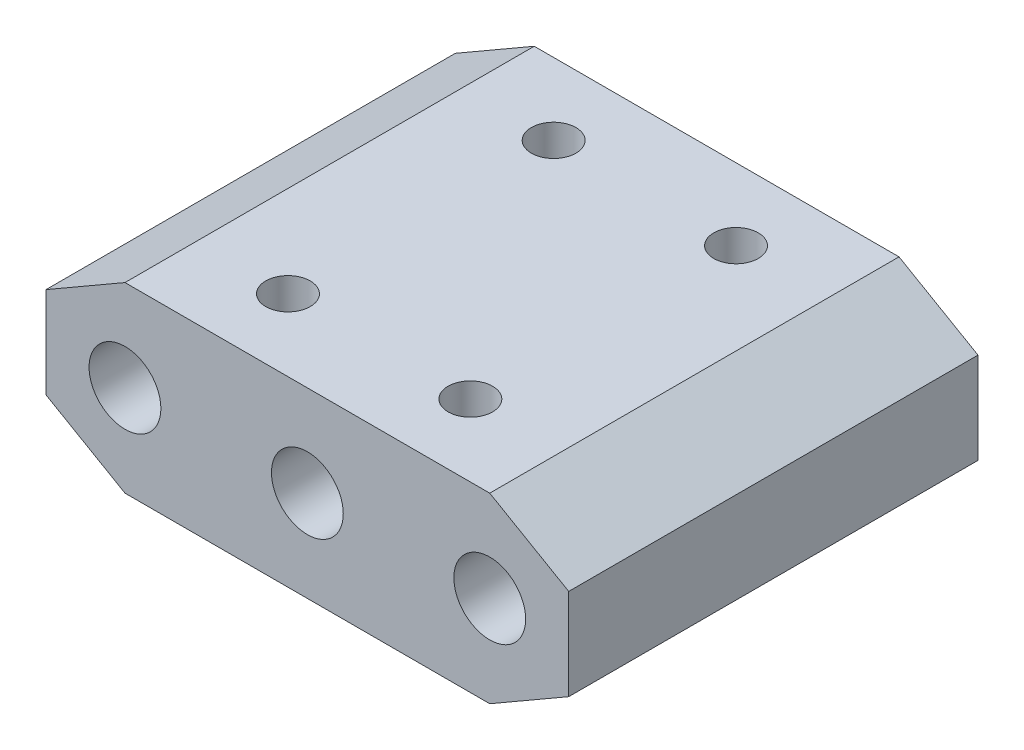
ISO-10303-21;
HEADER;
FILE_DESCRIPTION(('STEP AP214'),'2;1');
FILE_NAME('part.step','',(''),(''),'','','');
FILE_SCHEMA(('AUTOMOTIVE_DESIGN { 1 0 10303 214 1 1 1 1 }'));
ENDSEC;
DATA;
#1=APPLICATION_CONTEXT('core data for automotive mechanical design processes');
#2=APPLICATION_PROTOCOL_DEFINITION('international standard','automotive_design',2000,#1);
#3=PRODUCT_CONTEXT('',#1,'mechanical');
#4=PRODUCT('Part','Part','',(#3));
#5=PRODUCT_RELATED_PRODUCT_CATEGORY('part','',(#4));
#6=PRODUCT_DEFINITION_FORMATION('','',#4);
#7=PRODUCT_DEFINITION_CONTEXT('part definition',#1,'design');
#8=PRODUCT_DEFINITION('design','',#6,#7);
#9=PRODUCT_DEFINITION_SHAPE('','',#8);
#10=(LENGTH_UNIT() NAMED_UNIT(*) SI_UNIT(.MILLI.,.METRE.));
#11=(NAMED_UNIT(*) PLANE_ANGLE_UNIT() SI_UNIT($,.RADIAN.));
#12=(NAMED_UNIT(*) SI_UNIT($,.STERADIAN.) SOLID_ANGLE_UNIT());
#13=UNCERTAINTY_MEASURE_WITH_UNIT(LENGTH_MEASURE(1.E-05),#10,'distance_accuracy_value','');
#14=(GEOMETRIC_REPRESENTATION_CONTEXT(3) GLOBAL_UNCERTAINTY_ASSIGNED_CONTEXT((#13)) GLOBAL_UNIT_ASSIGNED_CONTEXT((#10,
#11,#12)) REPRESENTATION_CONTEXT('',''));
#15=CARTESIAN_POINT('',(0.,0.,0.));
#16=DIRECTION('',(0.,0.,1.));
#17=DIRECTION('',(1.,0.,0.));
#18=AXIS2_PLACEMENT_3D('',#15,#16,#17);
#19=CARTESIAN_POINT('',(0.,0.,-28.5));
#20=DIRECTION('',(0.,-1.,0.));
#21=DIRECTION('',(0.,0.,-1.));
#22=AXIS2_PLACEMENT_3D('',#19,#20,#21);
#23=PLANE('',#22);
#24=CARTESIAN_POINT('',(12.7,0.,-5.));
#25=DIRECTION('',(0.,1.,0.));
#26=DIRECTION('',(-1.,0.,0.));
#27=AXIS2_PLACEMENT_3D('',#24,#25,#26);
#28=CIRCLE('',#27,1.55);
#29=CARTESIAN_POINT('',(11.15,0.,-5.));
#30=VERTEX_POINT('',#29);
#31=EDGE_CURVE('E287',#30,#30,#28,.T.);
#32=ORIENTED_EDGE('',*,*,#31,.T.);
#33=EDGE_LOOP('',(#32));
#34=FACE_BOUND('',#33,.T.);
#35=CARTESIAN_POINT('',(25.4,0.,-5.));
#36=DIRECTION('',(0.,1.,0.));
#37=DIRECTION('',(-1.,0.,0.));
#38=AXIS2_PLACEMENT_3D('',#35,#36,#37);
#39=CIRCLE('',#38,1.55);
#40=CARTESIAN_POINT('',(23.85,0.,-5.));
#41=VERTEX_POINT('',#40);
#42=EDGE_CURVE('E273',#41,#41,#39,.T.);
#43=ORIENTED_EDGE('',*,*,#42,.T.);
#44=EDGE_LOOP('',(#43));
#45=FACE_BOUND('',#44,.T.);
#46=CARTESIAN_POINT('',(25.4,0.,-23.5));
#47=DIRECTION('',(0.,1.,0.));
#48=DIRECTION('',(-1.,0.,0.));
#49=AXIS2_PLACEMENT_3D('',#46,#47,#48);
#50=CIRCLE('',#49,1.55);
#51=CARTESIAN_POINT('',(23.85,0.,-23.5));
#52=VERTEX_POINT('',#51);
#53=EDGE_CURVE('E267',#52,#52,#50,.T.);
#54=ORIENTED_EDGE('',*,*,#53,.T.);
#55=EDGE_LOOP('',(#54));
#56=FACE_BOUND('',#55,.T.);
#57=CARTESIAN_POINT('',(12.7,0.,-23.5));
#58=DIRECTION('',(0.,1.,0.));
#59=DIRECTION('',(-1.,0.,0.));
#60=AXIS2_PLACEMENT_3D('',#57,#58,#59);
#61=CIRCLE('',#60,1.55);
#62=CARTESIAN_POINT('',(11.15,0.,-23.5));
#63=VERTEX_POINT('',#62);
#64=EDGE_CURVE('E295',#63,#63,#61,.T.);
#65=ORIENTED_EDGE('',*,*,#64,.T.);
#66=EDGE_LOOP('',(#65));
#67=FACE_BOUND('',#66,.T.);
#68=DIRECTION('',(1.,0.,0.));
#69=VECTOR('',#68,1.);
#70=CARTESIAN_POINT('',(0.,0.,0.));
#71=LINE('',#70,#69);
#72=CARTESIAN_POINT('',(6.35,0.,0.));
#73=VERTEX_POINT('',#72);
#74=CARTESIAN_POINT('',(31.75,0.,0.));
#75=VERTEX_POINT('',#74);
#76=EDGE_CURVE('E149',#73,#75,#71,.T.);
#77=ORIENTED_EDGE('',*,*,#76,.F.);
#78=DIRECTION('',(0.,0.,1.));
#79=VECTOR('',#78,1.);
#80=CARTESIAN_POINT('',(6.35,0.,-28.5));
#81=LINE('',#80,#79);
#82=CARTESIAN_POINT('',(6.35,0.,-28.5));
#83=VERTEX_POINT('',#82);
#84=EDGE_CURVE('E11',#83,#73,#81,.T.);
#85=ORIENTED_EDGE('',*,*,#84,.F.);
#86=DIRECTION('',(1.,0.,0.));
#87=VECTOR('',#86,1.);
#88=CARTESIAN_POINT('',(0.,0.,-28.5));
#89=LINE('',#88,#87);
#90=CARTESIAN_POINT('',(31.75,0.,-28.5));
#91=VERTEX_POINT('',#90);
#92=EDGE_CURVE('E178',#83,#91,#89,.T.);
#93=ORIENTED_EDGE('',*,*,#92,.T.);
#94=DIRECTION('',(0.,0.,1.));
#95=VECTOR('',#94,1.);
#96=CARTESIAN_POINT('',(31.75,0.,-28.5));
#97=LINE('',#96,#95);
#98=EDGE_CURVE('E49',#91,#75,#97,.T.);
#99=ORIENTED_EDGE('',*,*,#98,.T.);
#100=EDGE_LOOP('',(#77,#85,#93,#99));
#101=FACE_BOUND('',#100,.T.);
#102=ADVANCED_FACE('F46',(#34,#45,#56,#67,#101),#23,.T.);
#103=CARTESIAN_POINT('',(1.5875,2.74963065701559,-28.5));
#104=DIRECTION('',(-0.5,-0.866025403784439,0.));
#105=DIRECTION('',(0.866025403784439,-0.5,0.));
#106=AXIS2_PLACEMENT_3D('',#103,#104,#105);
#107=PLANE('',#106);
#108=DIRECTION('',(0.866025403784439,-0.5,0.));
#109=VECTOR('',#108,1.);
#110=CARTESIAN_POINT('',(1.5875,2.74963065701559,0.));
#111=LINE('',#110,#109);
#112=CARTESIAN_POINT('',(0.850738685968815,3.175,0.));
#113=VERTEX_POINT('',#112);
#114=EDGE_CURVE('E175',#113,#73,#111,.T.);
#115=ORIENTED_EDGE('',*,*,#114,.F.);
#116=DIRECTION('',(0.,0.,1.));
#117=VECTOR('',#116,1.);
#118=CARTESIAN_POINT('',(0.850738685968815,3.175,-28.5));
#119=LINE('',#118,#117);
#120=CARTESIAN_POINT('',(0.850738685968815,3.175,-28.5));
#121=VERTEX_POINT('',#120);
#122=EDGE_CURVE('E56',#121,#113,#119,.T.);
#123=ORIENTED_EDGE('',*,*,#122,.F.);
#124=DIRECTION('',(0.866025403784439,-0.5,0.));
#125=VECTOR('',#124,1.);
#126=CARTESIAN_POINT('',(1.5875,2.74963065701559,-28.5));
#127=LINE('',#126,#125);
#128=EDGE_CURVE('E133',#121,#83,#127,.T.);
#129=ORIENTED_EDGE('',*,*,#128,.T.);
#130=ORIENTED_EDGE('',*,*,#84,.T.);
#131=EDGE_LOOP('',(#115,#123,#129,#130));
#132=FACE_BOUND('',#131,.T.);
#133=ADVANCED_FACE('F198',(#132),#107,.T.);
#134=CARTESIAN_POINT('',(0.850738685968815,0.,-28.5));
#135=DIRECTION('',(-1.,0.,0.));
#136=DIRECTION('',(0.,-1.,0.));
#137=AXIS2_PLACEMENT_3D('',#134,#135,#136);
#138=PLANE('',#137);
#139=DIRECTION('',(0.,-1.,0.));
#140=VECTOR('',#139,1.);
#141=CARTESIAN_POINT('',(0.850738685968815,0.,0.));
#142=LINE('',#141,#140);
#143=CARTESIAN_POINT('',(0.850738685968815,9.525,0.));
#144=VERTEX_POINT('',#143);
#145=EDGE_CURVE('E121',#144,#113,#142,.T.);
#146=ORIENTED_EDGE('',*,*,#145,.F.);
#147=DIRECTION('',(0.,0.,1.));
#148=VECTOR('',#147,1.);
#149=CARTESIAN_POINT('',(0.850738685968815,9.525,-28.5));
#150=LINE('',#149,#148);
#151=CARTESIAN_POINT('',(0.850738685968815,9.525,-28.5));
#152=VERTEX_POINT('',#151);
#153=EDGE_CURVE('E116',#152,#144,#150,.T.);
#154=ORIENTED_EDGE('',*,*,#153,.F.);
#155=DIRECTION('',(0.,-1.,0.));
#156=VECTOR('',#155,1.);
#157=CARTESIAN_POINT('',(0.850738685968815,0.,-28.5));
#158=LINE('',#157,#156);
#159=EDGE_CURVE('E119',#152,#121,#158,.T.);
#160=ORIENTED_EDGE('',*,*,#159,.T.);
#161=ORIENTED_EDGE('',*,*,#122,.T.);
#162=EDGE_LOOP('',(#146,#154,#160,#161));
#163=FACE_BOUND('',#162,.T.);
#164=ADVANCED_FACE('F118',(#163),#138,.T.);
#165=CARTESIAN_POINT('',(-3.91176131403119,6.7753693429844,-28.5));
#166=DIRECTION('',(-0.5,0.866025403784438,0.));
#167=DIRECTION('',(-0.866025403784438,-0.5,0.));
#168=AXIS2_PLACEMENT_3D('',#165,#166,#167);
#169=PLANE('',#168);
#170=DIRECTION('',(-0.866025403784438,-0.5,0.));
#171=VECTOR('',#170,1.);
#172=CARTESIAN_POINT('',(-3.91176131403119,6.7753693429844,0.));
#173=LINE('',#172,#171);
#174=CARTESIAN_POINT('',(6.35000000000001,12.7,0.));
#175=VERTEX_POINT('',#174);
#176=EDGE_CURVE('E170',#175,#144,#173,.T.);
#177=ORIENTED_EDGE('',*,*,#176,.F.);
#178=DIRECTION('',(0.,0.,1.));
#179=VECTOR('',#178,1.);
#180=CARTESIAN_POINT('',(6.35000000000001,12.7,-28.5));
#181=LINE('',#180,#179);
#182=CARTESIAN_POINT('',(6.35000000000001,12.7,-28.5));
#183=VERTEX_POINT('',#182);
#184=EDGE_CURVE('E127',#183,#175,#181,.T.);
#185=ORIENTED_EDGE('',*,*,#184,.F.);
#186=DIRECTION('',(-0.866025403784438,-0.5,0.));
#187=VECTOR('',#186,1.);
#188=CARTESIAN_POINT('',(-3.91176131403119,6.7753693429844,-28.5));
#189=LINE('',#188,#187);
#190=EDGE_CURVE('E132',#183,#152,#189,.T.);
#191=ORIENTED_EDGE('',*,*,#190,.T.);
#192=ORIENTED_EDGE('',*,*,#153,.T.);
#193=EDGE_LOOP('',(#177,#185,#191,#192));
#194=FACE_BOUND('',#193,.T.);
#195=ADVANCED_FACE('F136',(#194),#169,.T.);
#196=CARTESIAN_POINT('',(0.,12.7,-28.5));
#197=DIRECTION('',(0.,-1.,0.));
#198=DIRECTION('',(1.,0.,0.));
#199=AXIS2_PLACEMENT_3D('',#196,#197,#198);
#200=PLANE('',#199);
#201=CARTESIAN_POINT('',(12.7,12.7,-5.));
#202=DIRECTION('',(0.,1.,0.));
#203=DIRECTION('',(-1.,0.,0.));
#204=AXIS2_PLACEMENT_3D('',#201,#202,#203);
#205=CIRCLE('',#204,1.55);
#206=CARTESIAN_POINT('',(11.15,12.7,-5.));
#207=VERTEX_POINT('',#206);
#208=EDGE_CURVE('E291',#207,#207,#205,.T.);
#209=ORIENTED_EDGE('',*,*,#208,.F.);
#210=EDGE_LOOP('',(#209));
#211=FACE_BOUND('',#210,.T.);
#212=CARTESIAN_POINT('',(25.4,12.7,-5.));
#213=DIRECTION('',(0.,1.,0.));
#214=DIRECTION('',(-1.,0.,0.));
#215=AXIS2_PLACEMENT_3D('',#212,#213,#214);
#216=CIRCLE('',#215,1.55);
#217=CARTESIAN_POINT('',(23.85,12.7,-5.));
#218=VERTEX_POINT('',#217);
#219=EDGE_CURVE('E281',#218,#218,#216,.T.);
#220=ORIENTED_EDGE('',*,*,#219,.F.);
#221=EDGE_LOOP('',(#220));
#222=FACE_BOUND('',#221,.T.);
#223=CARTESIAN_POINT('',(25.4,12.7,-23.5));
#224=DIRECTION('',(0.,1.,0.));
#225=DIRECTION('',(-1.,0.,0.));
#226=AXIS2_PLACEMENT_3D('',#223,#224,#225);
#227=CIRCLE('',#226,1.55);
#228=CARTESIAN_POINT('',(23.85,12.7,-23.5));
#229=VERTEX_POINT('',#228);
#230=EDGE_CURVE('E270',#229,#229,#227,.T.);
#231=ORIENTED_EDGE('',*,*,#230,.F.);
#232=EDGE_LOOP('',(#231));
#233=FACE_BOUND('',#232,.T.);
#234=CARTESIAN_POINT('',(12.7,12.7,-23.5));
#235=DIRECTION('',(0.,1.,0.));
#236=DIRECTION('',(-1.,0.,0.));
#237=AXIS2_PLACEMENT_3D('',#234,#235,#236);
#238=CIRCLE('',#237,1.55);
#239=CARTESIAN_POINT('',(11.15,12.7,-23.5));
#240=VERTEX_POINT('',#239);
#241=EDGE_CURVE('E278',#240,#240,#238,.T.);
#242=ORIENTED_EDGE('',*,*,#241,.F.);
#243=EDGE_LOOP('',(#242));
#244=FACE_BOUND('',#243,.T.);
#245=DIRECTION('',(1.,0.,0.));
#246=VECTOR('',#245,1.);
#247=CARTESIAN_POINT('',(0.,12.7,0.));
#248=LINE('',#247,#246);
#249=CARTESIAN_POINT('',(31.75,12.7,0.));
#250=VERTEX_POINT('',#249);
#251=EDGE_CURVE('E166',#175,#250,#248,.T.);
#252=ORIENTED_EDGE('',*,*,#251,.T.);
#253=DIRECTION('',(0.,0.,1.));
#254=VECTOR('',#253,1.);
#255=CARTESIAN_POINT('',(31.75,12.7,-28.5));
#256=LINE('',#255,#254);
#257=CARTESIAN_POINT('',(31.75,12.7,-28.5));
#258=VERTEX_POINT('',#257);
#259=EDGE_CURVE('E184',#258,#250,#256,.T.);
#260=ORIENTED_EDGE('',*,*,#259,.F.);
#261=DIRECTION('',(1.,0.,0.));
#262=VECTOR('',#261,1.);
#263=CARTESIAN_POINT('',(0.,12.7,-28.5));
#264=LINE('',#263,#262);
#265=EDGE_CURVE('E139',#183,#258,#264,.T.);
#266=ORIENTED_EDGE('',*,*,#265,.F.);
#267=ORIENTED_EDGE('',*,*,#184,.T.);
#268=EDGE_LOOP('',(#252,#260,#266,#267));
#269=FACE_BOUND('',#268,.T.);
#270=ADVANCED_FACE('F212',(#211,#222,#233,#244,#269),#200,.F.);
#271=CARTESIAN_POINT('',(13.4367613140312,23.273153285078,-28.5));
#272=DIRECTION('',(0.500000000000001,0.866025403784438,0.));
#273=DIRECTION('',(-0.866025403784438,0.500000000000001,0.));
#274=AXIS2_PLACEMENT_3D('',#271,#272,#273);
#275=PLANE('',#274);
#276=DIRECTION('',(-0.866025403784438,0.500000000000001,0.));
#277=VECTOR('',#276,1.);
#278=CARTESIAN_POINT('',(13.4367613140312,23.273153285078,0.));
#279=LINE('',#278,#277);
#280=CARTESIAN_POINT('',(37.2492613140312,9.52499999999999,0.));
#281=VERTEX_POINT('',#280);
#282=EDGE_CURVE('E162',#281,#250,#279,.T.);
#283=ORIENTED_EDGE('',*,*,#282,.F.);
#284=DIRECTION('',(0.,0.,1.));
#285=VECTOR('',#284,1.);
#286=CARTESIAN_POINT('',(37.2492613140312,9.52499999999999,-28.5));
#287=LINE('',#286,#285);
#288=CARTESIAN_POINT('',(37.2492613140312,9.52499999999999,-28.5));
#289=VERTEX_POINT('',#288);
#290=EDGE_CURVE('E187',#289,#281,#287,.T.);
#291=ORIENTED_EDGE('',*,*,#290,.F.);
#292=DIRECTION('',(-0.866025403784438,0.500000000000001,0.));
#293=VECTOR('',#292,1.);
#294=CARTESIAN_POINT('',(13.4367613140312,23.273153285078,-28.5));
#295=LINE('',#294,#293);
#296=EDGE_CURVE('E143',#289,#258,#295,.T.);
#297=ORIENTED_EDGE('',*,*,#296,.T.);
#298=ORIENTED_EDGE('',*,*,#259,.T.);
#299=EDGE_LOOP('',(#283,#291,#297,#298));
#300=FACE_BOUND('',#299,.T.);
#301=ADVANCED_FACE('F215',(#300),#275,.T.);
#302=CARTESIAN_POINT('',(37.2492613140312,0.,-28.5));
#303=DIRECTION('',(1.,0.,0.));
#304=DIRECTION('',(0.,0.,-1.));
#305=AXIS2_PLACEMENT_3D('',#302,#303,#304);
#306=PLANE('',#305);
#307=DIRECTION('',(0.,1.,0.));
#308=VECTOR('',#307,1.);
#309=CARTESIAN_POINT('',(37.2492613140312,0.,0.));
#310=LINE('',#309,#308);
#311=CARTESIAN_POINT('',(37.2492613140312,3.17499999999999,0.));
#312=VERTEX_POINT('',#311);
#313=EDGE_CURVE('E158',#312,#281,#310,.T.);
#314=ORIENTED_EDGE('',*,*,#313,.F.);
#315=DIRECTION('',(0.,0.,1.));
#316=VECTOR('',#315,1.);
#317=CARTESIAN_POINT('',(37.2492613140312,3.17499999999999,-28.5));
#318=LINE('',#317,#316);
#319=CARTESIAN_POINT('',(37.2492613140312,3.17499999999999,-28.5));
#320=VERTEX_POINT('',#319);
#321=EDGE_CURVE('E189',#320,#312,#318,.T.);
#322=ORIENTED_EDGE('',*,*,#321,.F.);
#323=DIRECTION('',(0.,1.,0.));
#324=VECTOR('',#323,1.);
#325=CARTESIAN_POINT('',(37.2492613140312,0.,-28.5));
#326=LINE('',#325,#324);
#327=EDGE_CURVE('E330',#320,#289,#326,.T.);
#328=ORIENTED_EDGE('',*,*,#327,.T.);
#329=ORIENTED_EDGE('',*,*,#290,.T.);
#330=EDGE_LOOP('',(#314,#322,#328,#329));
#331=FACE_BOUND('',#330,.T.);
#332=ADVANCED_FACE('F219',(#331),#306,.T.);
#333=CARTESIAN_POINT('',(7.93749999999999,-13.748153285078,-28.5));
#334=DIRECTION('',(0.5,-0.866025403784439,0.));
#335=DIRECTION('',(0.866025403784439,0.5,0.));
#336=AXIS2_PLACEMENT_3D('',#333,#334,#335);
#337=PLANE('',#336);
#338=DIRECTION('',(0.866025403784439,0.5,0.));
#339=VECTOR('',#338,1.);
#340=CARTESIAN_POINT('',(7.93749999999999,-13.748153285078,0.));
#341=LINE('',#340,#339);
#342=EDGE_CURVE('E153',#75,#312,#341,.T.);
#343=ORIENTED_EDGE('',*,*,#342,.F.);
#344=ORIENTED_EDGE('',*,*,#98,.F.);
#345=DIRECTION('',(0.866025403784439,0.5,0.));
#346=VECTOR('',#345,1.);
#347=CARTESIAN_POINT('',(7.93749999999999,-13.748153285078,-28.5));
#348=LINE('',#347,#346);
#349=EDGE_CURVE('E327',#91,#320,#348,.T.);
#350=ORIENTED_EDGE('',*,*,#349,.T.);
#351=ORIENTED_EDGE('',*,*,#321,.T.);
#352=EDGE_LOOP('',(#343,#344,#350,#351));
#353=FACE_BOUND('',#352,.T.);
#354=ADVANCED_FACE('F195',(#353),#337,.T.);
#355=CARTESIAN_POINT('',(0.,0.,-28.5));
#356=DIRECTION('',(0.,0.,1.));
#357=DIRECTION('',(1.,0.,0.));
#358=AXIS2_PLACEMENT_3D('',#355,#356,#357);
#359=PLANE('',#358);
#360=CARTESIAN_POINT('',(31.75,6.34999999999999,-28.5));
#361=DIRECTION('',(0.,0.,-1.));
#362=DIRECTION('',(-1.,0.,0.));
#363=AXIS2_PLACEMENT_3D('',#360,#361,#362);
#364=CIRCLE('',#363,2.49999999999999);
#365=CARTESIAN_POINT('',(29.25,6.34999999999999,-28.5));
#366=VERTEX_POINT('',#365);
#367=EDGE_CURVE('E299',#366,#366,#364,.T.);
#368=ORIENTED_EDGE('',*,*,#367,.F.);
#369=EDGE_LOOP('',(#368));
#370=FACE_BOUND('',#369,.T.);
#371=CARTESIAN_POINT('',(19.05,6.34999999999999,-28.5));
#372=DIRECTION('',(0.,0.,-1.));
#373=DIRECTION('',(-1.,0.,0.));
#374=AXIS2_PLACEMENT_3D('',#371,#372,#373);
#375=CIRCLE('',#374,2.49999999999999);
#376=CARTESIAN_POINT('',(16.55,6.34999999999999,-28.5));
#377=VERTEX_POINT('',#376);
#378=EDGE_CURVE('E306',#377,#377,#375,.T.);
#379=ORIENTED_EDGE('',*,*,#378,.F.);
#380=EDGE_LOOP('',(#379));
#381=FACE_BOUND('',#380,.T.);
#382=CARTESIAN_POINT('',(6.35,6.35,-28.5));
#383=DIRECTION('',(0.,0.,-1.));
#384=DIRECTION('',(-1.,0.,0.));
#385=AXIS2_PLACEMENT_3D('',#382,#383,#384);
#386=CIRCLE('',#385,2.49999999999999);
#387=CARTESIAN_POINT('',(3.85000000000001,6.35,-28.5));
#388=VERTEX_POINT('',#387);
#389=EDGE_CURVE('E310',#388,#388,#386,.T.);
#390=ORIENTED_EDGE('',*,*,#389,.F.);
#391=EDGE_LOOP('',(#390));
#392=FACE_BOUND('',#391,.T.);
#393=ORIENTED_EDGE('',*,*,#92,.F.);
#394=ORIENTED_EDGE('',*,*,#128,.F.);
#395=ORIENTED_EDGE('',*,*,#159,.F.);
#396=ORIENTED_EDGE('',*,*,#190,.F.);
#397=ORIENTED_EDGE('',*,*,#265,.T.);
#398=ORIENTED_EDGE('',*,*,#296,.F.);
#399=ORIENTED_EDGE('',*,*,#327,.F.);
#400=ORIENTED_EDGE('',*,*,#349,.F.);
#401=EDGE_LOOP('',(#393,#394,#395,#396,#397,#398,#399,#400));
#402=FACE_BOUND('',#401,.T.);
#403=ADVANCED_FACE('F131',(#370,#381,#392,#402),#359,.F.);
#404=CARTESIAN_POINT('',(0.,0.,0.));
#405=DIRECTION('',(0.,0.,1.));
#406=DIRECTION('',(1.,0.,0.));
#407=AXIS2_PLACEMENT_3D('',#404,#405,#406);
#408=PLANE('',#407);
#409=CARTESIAN_POINT('',(19.05,6.34999999999999,0.));
#410=DIRECTION('',(0.,0.,1.));
#411=DIRECTION('',(1.,0.,0.));
#412=AXIS2_PLACEMENT_3D('',#409,#410,#411);
#413=CIRCLE('',#412,2.49999999999999);
#414=CARTESIAN_POINT('',(21.55,6.34999999999999,0.));
#415=VERTEX_POINT('',#414);
#416=EDGE_CURVE('E314',#415,#415,#413,.T.);
#417=ORIENTED_EDGE('',*,*,#416,.F.);
#418=EDGE_LOOP('',(#417));
#419=FACE_BOUND('',#418,.T.);
#420=CARTESIAN_POINT('',(31.75,6.34999999999999,0.));
#421=DIRECTION('',(0.,0.,1.));
#422=DIRECTION('',(1.,0.,0.));
#423=AXIS2_PLACEMENT_3D('',#420,#421,#422);
#424=CIRCLE('',#423,2.49999999999999);
#425=CARTESIAN_POINT('',(34.25,6.34999999999999,0.));
#426=VERTEX_POINT('',#425);
#427=EDGE_CURVE('E318',#426,#426,#424,.T.);
#428=ORIENTED_EDGE('',*,*,#427,.F.);
#429=EDGE_LOOP('',(#428));
#430=FACE_BOUND('',#429,.T.);
#431=CARTESIAN_POINT('',(6.35,6.35,0.));
#432=DIRECTION('',(0.,0.,1.));
#433=DIRECTION('',(1.,0.,0.));
#434=AXIS2_PLACEMENT_3D('',#431,#432,#433);
#435=CIRCLE('',#434,2.49999999999999);
#436=CARTESIAN_POINT('',(8.84999999999999,6.35,0.));
#437=VERTEX_POINT('',#436);
#438=EDGE_CURVE('E154',#437,#437,#435,.T.);
#439=ORIENTED_EDGE('',*,*,#438,.F.);
#440=EDGE_LOOP('',(#439));
#441=FACE_BOUND('',#440,.T.);
#442=ORIENTED_EDGE('',*,*,#76,.T.);
#443=ORIENTED_EDGE('',*,*,#342,.T.);
#444=ORIENTED_EDGE('',*,*,#313,.T.);
#445=ORIENTED_EDGE('',*,*,#282,.T.);
#446=ORIENTED_EDGE('',*,*,#251,.F.);
#447=ORIENTED_EDGE('',*,*,#176,.T.);
#448=ORIENTED_EDGE('',*,*,#145,.T.);
#449=ORIENTED_EDGE('',*,*,#114,.T.);
#450=EDGE_LOOP('',(#442,#443,#444,#445,#446,#447,#448,#449));
#451=FACE_BOUND('',#450,.T.);
#452=ADVANCED_FACE('F197',(#419,#430,#441,#451),#408,.T.);
#453=CARTESIAN_POINT('',(6.35,6.35,0.));
#454=DIRECTION('',(0.,0.,1.));
#455=DIRECTION('',(1.,0.,0.));
#456=AXIS2_PLACEMENT_3D('',#453,#454,#455);
#457=CYLINDRICAL_SURFACE('',#456,2.49999999999999);
#458=ORIENTED_EDGE('',*,*,#438,.T.);
#459=EDGE_LOOP('',(#458));
#460=FACE_BOUND('',#459,.T.);
#461=ORIENTED_EDGE('',*,*,#389,.T.);
#462=EDGE_LOOP('',(#461));
#463=FACE_BOUND('',#462,.T.);
#464=ADVANCED_FACE('F231',(#460,#463),#457,.F.);
#465=CARTESIAN_POINT('',(31.75,6.34999999999999,0.));
#466=DIRECTION('',(0.,0.,1.));
#467=DIRECTION('',(1.,0.,0.));
#468=AXIS2_PLACEMENT_3D('',#465,#466,#467);
#469=CYLINDRICAL_SURFACE('',#468,2.49999999999999);
#470=ORIENTED_EDGE('',*,*,#427,.T.);
#471=EDGE_LOOP('',(#470));
#472=FACE_BOUND('',#471,.T.);
#473=ORIENTED_EDGE('',*,*,#367,.T.);
#474=EDGE_LOOP('',(#473));
#475=FACE_BOUND('',#474,.T.);
#476=ADVANCED_FACE('F238',(#472,#475),#469,.F.);
#477=CARTESIAN_POINT('',(19.05,6.34999999999999,0.));
#478=DIRECTION('',(0.,0.,1.));
#479=DIRECTION('',(1.,0.,0.));
#480=AXIS2_PLACEMENT_3D('',#477,#478,#479);
#481=CYLINDRICAL_SURFACE('',#480,2.49999999999999);
#482=ORIENTED_EDGE('',*,*,#416,.T.);
#483=EDGE_LOOP('',(#482));
#484=FACE_BOUND('',#483,.T.);
#485=ORIENTED_EDGE('',*,*,#378,.T.);
#486=EDGE_LOOP('',(#485));
#487=FACE_BOUND('',#486,.T.);
#488=ADVANCED_FACE('F242',(#484,#487),#481,.F.);
#489=CARTESIAN_POINT('',(12.7,0.,-23.5));
#490=DIRECTION('',(0.,1.,0.));
#491=DIRECTION('',(-1.,0.,0.));
#492=AXIS2_PLACEMENT_3D('',#489,#490,#491);
#493=CYLINDRICAL_SURFACE('',#492,1.55);
#494=ORIENTED_EDGE('',*,*,#64,.F.);
#495=EDGE_LOOP('',(#494));
#496=FACE_BOUND('',#495,.T.);
#497=ORIENTED_EDGE('',*,*,#241,.T.);
#498=EDGE_LOOP('',(#497));
#499=FACE_BOUND('',#498,.T.);
#500=ADVANCED_FACE('F246',(#496,#499),#493,.F.);
#501=CARTESIAN_POINT('',(25.4,0.,-23.5));
#502=DIRECTION('',(0.,1.,0.));
#503=DIRECTION('',(-1.,0.,0.));
#504=AXIS2_PLACEMENT_3D('',#501,#502,#503);
#505=CYLINDRICAL_SURFACE('',#504,1.55);
#506=ORIENTED_EDGE('',*,*,#53,.F.);
#507=EDGE_LOOP('',(#506));
#508=FACE_BOUND('',#507,.T.);
#509=ORIENTED_EDGE('',*,*,#230,.T.);
#510=EDGE_LOOP('',(#509));
#511=FACE_BOUND('',#510,.T.);
#512=ADVANCED_FACE('F250',(#508,#511),#505,.F.);
#513=CARTESIAN_POINT('',(25.4,0.,-5.));
#514=DIRECTION('',(0.,1.,0.));
#515=DIRECTION('',(-1.,0.,0.));
#516=AXIS2_PLACEMENT_3D('',#513,#514,#515);
#517=CYLINDRICAL_SURFACE('',#516,1.55);
#518=ORIENTED_EDGE('',*,*,#42,.F.);
#519=EDGE_LOOP('',(#518));
#520=FACE_BOUND('',#519,.T.);
#521=ORIENTED_EDGE('',*,*,#219,.T.);
#522=EDGE_LOOP('',(#521));
#523=FACE_BOUND('',#522,.T.);
#524=ADVANCED_FACE('F255',(#520,#523),#517,.F.);
#525=CARTESIAN_POINT('',(12.7,0.,-5.));
#526=DIRECTION('',(0.,1.,0.));
#527=DIRECTION('',(-1.,0.,0.));
#528=AXIS2_PLACEMENT_3D('',#525,#526,#527);
#529=CYLINDRICAL_SURFACE('',#528,1.55);
#530=ORIENTED_EDGE('',*,*,#31,.F.);
#531=EDGE_LOOP('',(#530));
#532=FACE_BOUND('',#531,.T.);
#533=ORIENTED_EDGE('',*,*,#208,.T.);
#534=EDGE_LOOP('',(#533));
#535=FACE_BOUND('',#534,.T.);
#536=ADVANCED_FACE('F252',(#532,#535),#529,.F.);
#537=CLOSED_SHELL('',(#102,#133,#164,#195,#270,#301,#332,#354,#403,#452,#464,#476,#488,#500,
#512,#524,#536));
#538=MANIFOLD_SOLID_BREP('B2',#537);
#539=ADVANCED_BREP_SHAPE_REPRESENTATION('',(#18,#538),#14);
#540=SHAPE_DEFINITION_REPRESENTATION(#9,#539);
ENDSEC;
END-ISO-10303-21;
